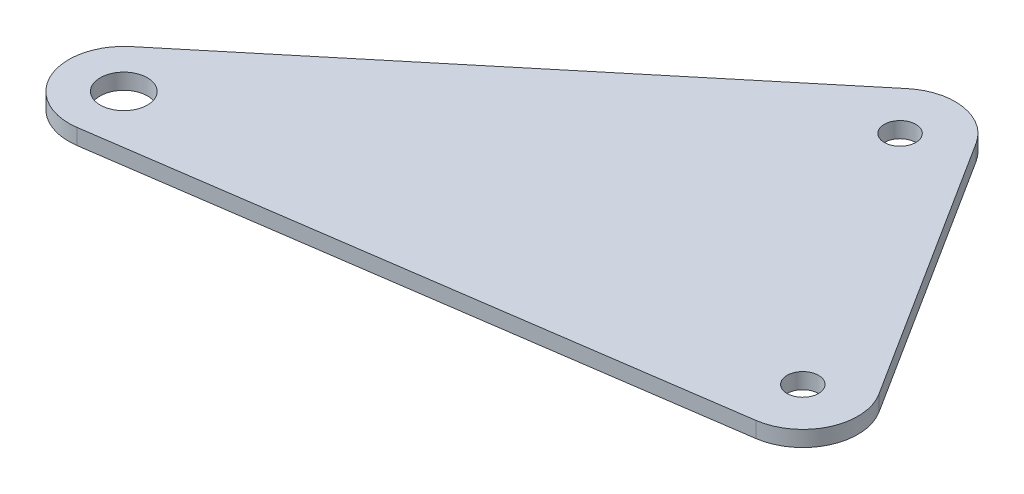
ISO-10303-21;
HEADER;
FILE_DESCRIPTION(('STEP AP214'),'2;1');
FILE_NAME('part.step','',(''),(''),'','','');
FILE_SCHEMA(('AUTOMOTIVE_DESIGN { 1 0 10303 214 1 1 1 1 }'));
ENDSEC;
DATA;
#1=APPLICATION_CONTEXT('core data for automotive mechanical design processes');
#2=APPLICATION_PROTOCOL_DEFINITION('international standard','automotive_design',2000,#1);
#3=PRODUCT_CONTEXT('',#1,'mechanical');
#4=PRODUCT('Part','Part','',(#3));
#5=PRODUCT_RELATED_PRODUCT_CATEGORY('part','',(#4));
#6=PRODUCT_DEFINITION_FORMATION('','',#4);
#7=PRODUCT_DEFINITION_CONTEXT('part definition',#1,'design');
#8=PRODUCT_DEFINITION('design','',#6,#7);
#9=PRODUCT_DEFINITION_SHAPE('','',#8);
#10=(LENGTH_UNIT() NAMED_UNIT(*) SI_UNIT(.MILLI.,.METRE.));
#11=(NAMED_UNIT(*) PLANE_ANGLE_UNIT() SI_UNIT($,.RADIAN.));
#12=(NAMED_UNIT(*) SI_UNIT($,.STERADIAN.) SOLID_ANGLE_UNIT());
#13=UNCERTAINTY_MEASURE_WITH_UNIT(LENGTH_MEASURE(1.E-05),#10,'distance_accuracy_value','');
#14=(GEOMETRIC_REPRESENTATION_CONTEXT(3) GLOBAL_UNCERTAINTY_ASSIGNED_CONTEXT((#13)) GLOBAL_UNIT_ASSIGNED_CONTEXT((#10,
#11,#12)) REPRESENTATION_CONTEXT('',''));
#15=CARTESIAN_POINT('',(0.,0.,0.));
#16=DIRECTION('',(0.,0.,1.));
#17=DIRECTION('',(1.,0.,0.));
#18=AXIS2_PLACEMENT_3D('',#15,#16,#17);
#19=CARTESIAN_POINT('',(1879.07689268095,2.,1032.16454737156));
#20=DIRECTION('',(0.,1.,0.));
#21=DIRECTION('',(0.,0.,1.));
#22=AXIS2_PLACEMENT_3D('',#19,#20,#21);
#23=PLANE('',#22);
#24=CARTESIAN_POINT('',(1857.64903987547,2.,998.388118842978));
#25=DIRECTION('',(0.,1.,0.));
#26=DIRECTION('',(0.,0.,1.));
#27=AXIS2_PLACEMENT_3D('',#24,#25,#26);
#28=CIRCLE('',#27,2.0000000000001);
#29=CARTESIAN_POINT('',(1857.64903987547,2.,1000.38811884298));
#30=VERTEX_POINT('',#29);
#31=EDGE_CURVE('E185',#30,#30,#28,.T.);
#32=ORIENTED_EDGE('',*,*,#31,.F.);
#33=EDGE_LOOP('',(#32));
#34=FACE_BOUND('',#33,.T.);
#35=CARTESIAN_POINT('',(1879.07689268095,2.,1032.16454737156));
#36=DIRECTION('',(0.,1.,0.));
#37=DIRECTION('',(0.,0.,1.));
#38=AXIS2_PLACEMENT_3D('',#35,#36,#37);
#39=CIRCLE('',#38,7.00000000000004);
#40=CARTESIAN_POINT('',(1880.077927524,2.,1039.09260115621));
#41=VERTEX_POINT('',#40);
#42=CARTESIAN_POINT('',(1884.98776767346,2.,1028.4146731306));
#43=VERTEX_POINT('',#42);
#44=EDGE_CURVE('E130',#41,#43,#39,.T.);
#45=ORIENTED_EDGE('',*,*,#44,.T.);
#46=DIRECTION('',(-0.535696320137016,0.,-0.844410713214642));
#47=VECTOR('',#46,1.);
#48=CARTESIAN_POINT('',(1884.98776767346,2.,1028.4146731306));
#49=LINE('',#48,#47);
#50=CARTESIAN_POINT('',(1863.55991486798,2.,994.638244602019));
#51=VERTEX_POINT('',#50);
#52=EDGE_CURVE('E88',#43,#51,#49,.T.);
#53=ORIENTED_EDGE('',*,*,#52,.T.);
#54=CARTESIAN_POINT('',(1857.64903987547,2.,998.388118842978));
#55=DIRECTION('',(0.,1.,0.));
#56=DIRECTION('',(0.,0.,1.));
#57=AXIS2_PLACEMENT_3D('',#54,#55,#56);
#58=CIRCLE('',#57,6.99999999999981);
#59=CARTESIAN_POINT('',(1853.18295756995,2.,992.997932497383));
#60=VERTEX_POINT('',#59);
#61=EDGE_CURVE('E101',#51,#60,#58,.T.);
#62=ORIENTED_EDGE('',*,*,#61,.T.);
#63=DIRECTION('',(-0.770026620799455,0.,0.638011757932542));
#64=VECTOR('',#63,1.);
#65=CARTESIAN_POINT('',(1799.28109411394,2.,1037.6587555527));
#66=LINE('',#65,#64);
#67=CARTESIAN_POINT('',(1799.28109411394,2.,1037.6587555527));
#68=VERTEX_POINT('',#67);
#69=EDGE_CURVE('E95',#60,#68,#66,.T.);
#70=ORIENTED_EDGE('',*,*,#69,.T.);
#71=CARTESIAN_POINT('',(1803.74717641947,2.,1043.04894189829));
#72=DIRECTION('',(0.,1.,0.));
#73=DIRECTION('',(0.,0.,1.));
#74=AXIS2_PLACEMENT_3D('',#71,#72,#73);
#75=CIRCLE('',#74,6.99999999999989);
#76=CARTESIAN_POINT('',(1804.74821126252,2.,1049.97699568294));
#77=VERTEX_POINT('',#76);
#78=EDGE_CURVE('E99',#68,#77,#75,.T.);
#79=ORIENTED_EDGE('',*,*,#78,.T.);
#80=DIRECTION('',(0.989721969235761,0.,-0.143004977578013));
#81=VECTOR('',#80,1.);
#82=CARTESIAN_POINT('',(1880.077927524,2.,1039.09260115621));
#83=LINE('',#82,#81);
#84=EDGE_CURVE('E51',#77,#41,#83,.T.);
#85=ORIENTED_EDGE('',*,*,#84,.T.);
#86=EDGE_LOOP('',(#45,#53,#62,#70,#79,#85));
#87=FACE_BOUND('',#86,.T.);
#88=CARTESIAN_POINT('',(1803.74717641947,2.,1043.04894189829));
#89=DIRECTION('',(0.,1.,0.));
#90=DIRECTION('',(0.,0.,1.));
#91=AXIS2_PLACEMENT_3D('',#88,#89,#90);
#92=CIRCLE('',#91,2.99999999999994);
#93=CARTESIAN_POINT('',(1803.74717641947,2.,1046.04894189829));
#94=VERTEX_POINT('',#93);
#95=EDGE_CURVE('E123',#94,#94,#92,.T.);
#96=ORIENTED_EDGE('',*,*,#95,.F.);
#97=EDGE_LOOP('',(#96));
#98=FACE_BOUND('',#97,.T.);
#99=CARTESIAN_POINT('',(1879.07689268095,2.,1032.16454737156));
#100=DIRECTION('',(0.,1.,0.));
#101=DIRECTION('',(0.,0.,1.));
#102=AXIS2_PLACEMENT_3D('',#99,#100,#101);
#103=CIRCLE('',#102,2.0000000000001);
#104=CARTESIAN_POINT('',(1879.07689268095,2.,1034.16454737156));
#105=VERTEX_POINT('',#104);
#106=EDGE_CURVE('E176',#105,#105,#103,.T.);
#107=ORIENTED_EDGE('',*,*,#106,.F.);
#108=EDGE_LOOP('',(#107));
#109=FACE_BOUND('',#108,.T.);
#110=ADVANCED_FACE('F34',(#34,#87,#98,#109),#23,.T.);
#111=CARTESIAN_POINT('',(1879.07689268095,0.,1032.16454737156));
#112=DIRECTION('',(0.,1.,0.));
#113=DIRECTION('',(0.,0.,1.));
#114=AXIS2_PLACEMENT_3D('',#111,#112,#113);
#115=PLANE('',#114);
#116=CARTESIAN_POINT('',(1879.07689268095,0.,1032.16454737156));
#117=DIRECTION('',(0.,1.,0.));
#118=DIRECTION('',(0.,0.,1.));
#119=AXIS2_PLACEMENT_3D('',#116,#117,#118);
#120=CIRCLE('',#119,7.00000000000004);
#121=CARTESIAN_POINT('',(1880.077927524,0.,1039.09260115621));
#122=VERTEX_POINT('',#121);
#123=CARTESIAN_POINT('',(1884.98776767346,0.,1028.4146731306));
#124=VERTEX_POINT('',#123);
#125=EDGE_CURVE('E119',#122,#124,#120,.T.);
#126=ORIENTED_EDGE('',*,*,#125,.F.);
#127=DIRECTION('',(0.989721969235761,0.,-0.143004977578013));
#128=VECTOR('',#127,1.);
#129=CARTESIAN_POINT('',(1880.077927524,0.,1039.09260115621));
#130=LINE('',#129,#128);
#131=CARTESIAN_POINT('',(1804.74821126252,0.,1049.97699568294));
#132=VERTEX_POINT('',#131);
#133=EDGE_CURVE('E80',#132,#122,#130,.T.);
#134=ORIENTED_EDGE('',*,*,#133,.F.);
#135=CARTESIAN_POINT('',(1803.74717641947,0.,1043.04894189829));
#136=DIRECTION('',(0.,1.,0.));
#137=DIRECTION('',(0.,0.,1.));
#138=AXIS2_PLACEMENT_3D('',#135,#136,#137);
#139=CIRCLE('',#138,6.99999999999989);
#140=CARTESIAN_POINT('',(1799.28109411394,0.,1037.6587555527));
#141=VERTEX_POINT('',#140);
#142=EDGE_CURVE('E74',#141,#132,#139,.T.);
#143=ORIENTED_EDGE('',*,*,#142,.F.);
#144=DIRECTION('',(-0.770026620799455,0.,0.638011757932542));
#145=VECTOR('',#144,1.);
#146=CARTESIAN_POINT('',(1799.28109411394,0.,1037.6587555527));
#147=LINE('',#146,#145);
#148=CARTESIAN_POINT('',(1853.18295756995,0.,992.997932497383));
#149=VERTEX_POINT('',#148);
#150=EDGE_CURVE('E109',#149,#141,#147,.T.);
#151=ORIENTED_EDGE('',*,*,#150,.F.);
#152=CARTESIAN_POINT('',(1857.64903987547,0.,998.388118842978));
#153=DIRECTION('',(0.,1.,0.));
#154=DIRECTION('',(0.,0.,1.));
#155=AXIS2_PLACEMENT_3D('',#152,#153,#154);
#156=CIRCLE('',#155,6.99999999999981);
#157=CARTESIAN_POINT('',(1863.55991486798,0.,994.638244602019));
#158=VERTEX_POINT('',#157);
#159=EDGE_CURVE('E125',#158,#149,#156,.T.);
#160=ORIENTED_EDGE('',*,*,#159,.F.);
#161=DIRECTION('',(-0.535696320137016,0.,-0.844410713214642));
#162=VECTOR('',#161,1.);
#163=CARTESIAN_POINT('',(1884.98776767346,0.,1028.4146731306));
#164=LINE('',#163,#162);
#165=EDGE_CURVE('E122',#124,#158,#164,.T.);
#166=ORIENTED_EDGE('',*,*,#165,.F.);
#167=EDGE_LOOP('',(#126,#134,#143,#151,#160,#166));
#168=FACE_BOUND('',#167,.T.);
#169=CARTESIAN_POINT('',(1803.74717641947,0.,1043.04894189829));
#170=DIRECTION('',(0.,1.,0.));
#171=DIRECTION('',(0.,0.,1.));
#172=AXIS2_PLACEMENT_3D('',#169,#170,#171);
#173=CIRCLE('',#172,2.99999999999994);
#174=CARTESIAN_POINT('',(1803.74717641947,0.,1046.04894189829));
#175=VERTEX_POINT('',#174);
#176=EDGE_CURVE('E188',#175,#175,#173,.T.);
#177=ORIENTED_EDGE('',*,*,#176,.T.);
#178=EDGE_LOOP('',(#177));
#179=FACE_BOUND('',#178,.T.);
#180=CARTESIAN_POINT('',(1857.64903987547,0.,998.388118842978));
#181=DIRECTION('',(0.,1.,0.));
#182=DIRECTION('',(0.,0.,1.));
#183=AXIS2_PLACEMENT_3D('',#180,#181,#182);
#184=CIRCLE('',#183,2.0000000000001);
#185=CARTESIAN_POINT('',(1857.64903987547,0.,1000.38811884298));
#186=VERTEX_POINT('',#185);
#187=EDGE_CURVE('E182',#186,#186,#184,.T.);
#188=ORIENTED_EDGE('',*,*,#187,.T.);
#189=EDGE_LOOP('',(#188));
#190=FACE_BOUND('',#189,.T.);
#191=CARTESIAN_POINT('',(1879.07689268095,0.,1032.16454737156));
#192=DIRECTION('',(0.,1.,0.));
#193=DIRECTION('',(0.,0.,1.));
#194=AXIS2_PLACEMENT_3D('',#191,#192,#193);
#195=CIRCLE('',#194,2.0000000000001);
#196=CARTESIAN_POINT('',(1879.07689268095,0.,1034.16454737156));
#197=VERTEX_POINT('',#196);
#198=EDGE_CURVE('E179',#197,#197,#195,.T.);
#199=ORIENTED_EDGE('',*,*,#198,.T.);
#200=EDGE_LOOP('',(#199));
#201=FACE_BOUND('',#200,.T.);
#202=ADVANCED_FACE('F139',(#168,#179,#190,#201),#115,.F.);
#203=CARTESIAN_POINT('',(1879.07689268095,2.,1032.16454737156));
#204=DIRECTION('',(0.,-1.,0.));
#205=DIRECTION('',(0.,0.,-1.));
#206=AXIS2_PLACEMENT_3D('',#203,#204,#205);
#207=CYLINDRICAL_SURFACE('',#206,7.00000000000004);
#208=ORIENTED_EDGE('',*,*,#125,.T.);
#209=DIRECTION('',(0.,-1.,0.));
#210=VECTOR('',#209,1.);
#211=CARTESIAN_POINT('',(1884.98776767346,2.,1028.4146731306));
#212=LINE('',#211,#210);
#213=EDGE_CURVE('E11',#43,#124,#212,.T.);
#214=ORIENTED_EDGE('',*,*,#213,.F.);
#215=ORIENTED_EDGE('',*,*,#44,.F.);
#216=DIRECTION('',(0.,-1.,0.));
#217=VECTOR('',#216,1.);
#218=CARTESIAN_POINT('',(1880.077927524,2.,1039.09260115621));
#219=LINE('',#218,#217);
#220=EDGE_CURVE('E115',#41,#122,#219,.T.);
#221=ORIENTED_EDGE('',*,*,#220,.T.);
#222=EDGE_LOOP('',(#208,#214,#215,#221));
#223=FACE_BOUND('',#222,.T.);
#224=ADVANCED_FACE('F36',(#223),#207,.T.);
#225=CARTESIAN_POINT('',(1884.98776767346,2.,1028.4146731306));
#226=DIRECTION('',(-0.844410713214642,0.,0.535696320137016));
#227=DIRECTION('',(0.535696320137016,0.,0.844410713214642));
#228=AXIS2_PLACEMENT_3D('',#225,#226,#227);
#229=PLANE('',#228);
#230=ORIENTED_EDGE('',*,*,#165,.T.);
#231=DIRECTION('',(0.,-1.,0.));
#232=VECTOR('',#231,1.);
#233=CARTESIAN_POINT('',(1863.55991486798,2.,994.638244602019));
#234=LINE('',#233,#232);
#235=EDGE_CURVE('E43',#51,#158,#234,.T.);
#236=ORIENTED_EDGE('',*,*,#235,.F.);
#237=ORIENTED_EDGE('',*,*,#52,.F.);
#238=ORIENTED_EDGE('',*,*,#213,.T.);
#239=EDGE_LOOP('',(#230,#236,#237,#238));
#240=FACE_BOUND('',#239,.T.);
#241=ADVANCED_FACE('F238',(#240),#229,.F.);
#242=CARTESIAN_POINT('',(1857.64903987547,2.,998.388118842978));
#243=DIRECTION('',(0.,-1.,0.));
#244=DIRECTION('',(0.,0.,-1.));
#245=AXIS2_PLACEMENT_3D('',#242,#243,#244);
#246=CYLINDRICAL_SURFACE('',#245,6.99999999999981);
#247=ORIENTED_EDGE('',*,*,#159,.T.);
#248=DIRECTION('',(0.,-1.,0.));
#249=VECTOR('',#248,1.);
#250=CARTESIAN_POINT('',(1853.18295756995,2.,992.997932497383));
#251=LINE('',#250,#249);
#252=EDGE_CURVE('E110',#60,#149,#251,.T.);
#253=ORIENTED_EDGE('',*,*,#252,.F.);
#254=ORIENTED_EDGE('',*,*,#61,.F.);
#255=ORIENTED_EDGE('',*,*,#235,.T.);
#256=EDGE_LOOP('',(#247,#253,#254,#255));
#257=FACE_BOUND('',#256,.T.);
#258=ADVANCED_FACE('F136',(#257),#246,.T.);
#259=CARTESIAN_POINT('',(1799.28109411394,2.,1037.6587555527));
#260=DIRECTION('',(0.638011757932542,0.,0.770026620799455));
#261=DIRECTION('',(0.770026620799455,0.,-0.638011757932542));
#262=AXIS2_PLACEMENT_3D('',#259,#260,#261);
#263=PLANE('',#262);
#264=ORIENTED_EDGE('',*,*,#150,.T.);
#265=DIRECTION('',(0.,-1.,0.));
#266=VECTOR('',#265,1.);
#267=CARTESIAN_POINT('',(1799.28109411394,2.,1037.6587555527));
#268=LINE('',#267,#266);
#269=EDGE_CURVE('E106',#68,#141,#268,.T.);
#270=ORIENTED_EDGE('',*,*,#269,.F.);
#271=ORIENTED_EDGE('',*,*,#69,.F.);
#272=ORIENTED_EDGE('',*,*,#252,.T.);
#273=EDGE_LOOP('',(#264,#270,#271,#272));
#274=FACE_BOUND('',#273,.T.);
#275=ADVANCED_FACE('F107',(#274),#263,.F.);
#276=CARTESIAN_POINT('',(1803.74717641947,2.,1043.04894189829));
#277=DIRECTION('',(0.,-1.,0.));
#278=DIRECTION('',(0.,0.,-1.));
#279=AXIS2_PLACEMENT_3D('',#276,#277,#278);
#280=CYLINDRICAL_SURFACE('',#279,6.99999999999989);
#281=ORIENTED_EDGE('',*,*,#142,.T.);
#282=DIRECTION('',(0.,-1.,0.));
#283=VECTOR('',#282,1.);
#284=CARTESIAN_POINT('',(1804.74821126252,2.,1049.97699568294));
#285=LINE('',#284,#283);
#286=EDGE_CURVE('E111',#77,#132,#285,.T.);
#287=ORIENTED_EDGE('',*,*,#286,.F.);
#288=ORIENTED_EDGE('',*,*,#78,.F.);
#289=ORIENTED_EDGE('',*,*,#269,.T.);
#290=EDGE_LOOP('',(#281,#287,#288,#289));
#291=FACE_BOUND('',#290,.T.);
#292=ADVANCED_FACE('F113',(#291),#280,.T.);
#293=CARTESIAN_POINT('',(1880.077927524,2.,1039.09260115621));
#294=DIRECTION('',(-0.143004977578013,0.,-0.989721969235761));
#295=DIRECTION('',(-0.989721969235761,0.,0.143004977578013));
#296=AXIS2_PLACEMENT_3D('',#293,#294,#295);
#297=PLANE('',#296);
#298=ORIENTED_EDGE('',*,*,#133,.T.);
#299=ORIENTED_EDGE('',*,*,#220,.F.);
#300=ORIENTED_EDGE('',*,*,#84,.F.);
#301=ORIENTED_EDGE('',*,*,#286,.T.);
#302=EDGE_LOOP('',(#298,#299,#300,#301));
#303=FACE_BOUND('',#302,.T.);
#304=ADVANCED_FACE('F144',(#303),#297,.F.);
#305=CARTESIAN_POINT('',(1803.74717641947,2.,1043.04894189829));
#306=DIRECTION('',(0.,-1.,0.));
#307=DIRECTION('',(0.,0.,-1.));
#308=AXIS2_PLACEMENT_3D('',#305,#306,#307);
#309=CYLINDRICAL_SURFACE('',#308,2.99999999999994);
#310=ORIENTED_EDGE('',*,*,#95,.T.);
#311=EDGE_LOOP('',(#310));
#312=FACE_BOUND('',#311,.T.);
#313=ORIENTED_EDGE('',*,*,#176,.F.);
#314=EDGE_LOOP('',(#313));
#315=FACE_BOUND('',#314,.T.);
#316=ADVANCED_FACE('F146',(#312,#315),#309,.F.);
#317=CARTESIAN_POINT('',(1857.64903987547,2.,998.388118842978));
#318=DIRECTION('',(0.,-1.,0.));
#319=DIRECTION('',(0.,0.,-1.));
#320=AXIS2_PLACEMENT_3D('',#317,#318,#319);
#321=CYLINDRICAL_SURFACE('',#320,2.0000000000001);
#322=ORIENTED_EDGE('',*,*,#31,.T.);
#323=EDGE_LOOP('',(#322));
#324=FACE_BOUND('',#323,.T.);
#325=ORIENTED_EDGE('',*,*,#187,.F.);
#326=EDGE_LOOP('',(#325));
#327=FACE_BOUND('',#326,.T.);
#328=ADVANCED_FACE('F152',(#324,#327),#321,.F.);
#329=CARTESIAN_POINT('',(1879.07689268095,2.,1032.16454737156));
#330=DIRECTION('',(0.,-1.,0.));
#331=DIRECTION('',(0.,0.,-1.));
#332=AXIS2_PLACEMENT_3D('',#329,#330,#331);
#333=CYLINDRICAL_SURFACE('',#332,2.0000000000001);
#334=ORIENTED_EDGE('',*,*,#106,.T.);
#335=EDGE_LOOP('',(#334));
#336=FACE_BOUND('',#335,.T.);
#337=ORIENTED_EDGE('',*,*,#198,.F.);
#338=EDGE_LOOP('',(#337));
#339=FACE_BOUND('',#338,.T.);
#340=ADVANCED_FACE('F167',(#336,#339),#333,.F.);
#341=CLOSED_SHELL('',(#110,#202,#224,#241,#258,#275,#292,#304,#316,#328,#340));
#342=MANIFOLD_SOLID_BREP('B2',#341);
#343=ADVANCED_BREP_SHAPE_REPRESENTATION('',(#18,#342),#14);
#344=SHAPE_DEFINITION_REPRESENTATION(#9,#343);
ENDSEC;
END-ISO-10303-21;
